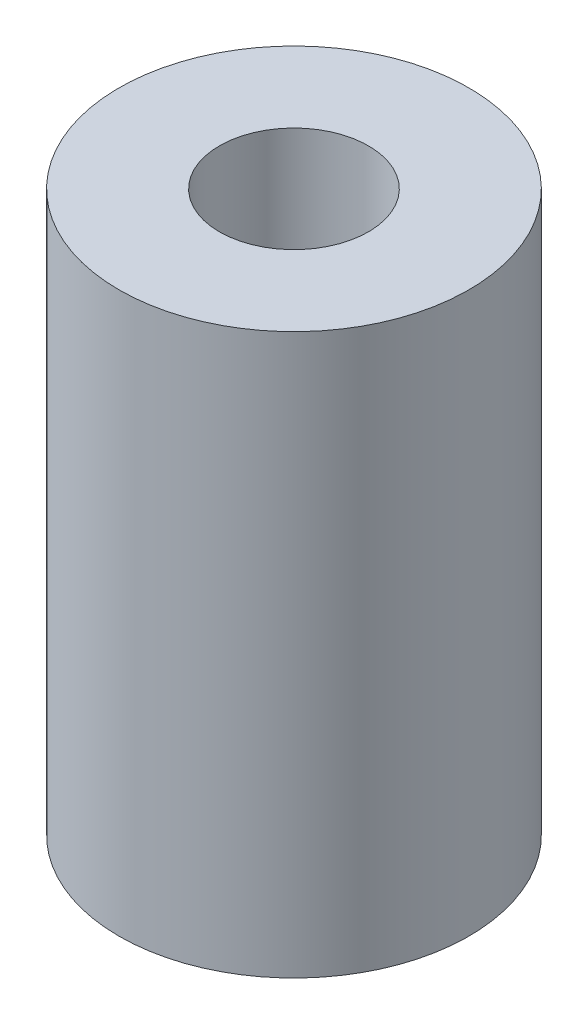
ISO-10303-21;
HEADER;
FILE_DESCRIPTION(('STEP AP214'),'2;1');
FILE_NAME('part.step','',(''),(''),'','','');
FILE_SCHEMA(('AUTOMOTIVE_DESIGN { 1 0 10303 214 1 1 1 1 }'));
ENDSEC;
DATA;
#1=APPLICATION_CONTEXT('core data for automotive mechanical design processes');
#2=APPLICATION_PROTOCOL_DEFINITION('international standard','automotive_design',2000,#1);
#3=PRODUCT_CONTEXT('',#1,'mechanical');
#4=PRODUCT('Part','Part','',(#3));
#5=PRODUCT_RELATED_PRODUCT_CATEGORY('part','',(#4));
#6=PRODUCT_DEFINITION_FORMATION('','',#4);
#7=PRODUCT_DEFINITION_CONTEXT('part definition',#1,'design');
#8=PRODUCT_DEFINITION('design','',#6,#7);
#9=PRODUCT_DEFINITION_SHAPE('','',#8);
#10=(LENGTH_UNIT() NAMED_UNIT(*) SI_UNIT(.MILLI.,.METRE.));
#11=(NAMED_UNIT(*) PLANE_ANGLE_UNIT() SI_UNIT($,.RADIAN.));
#12=(NAMED_UNIT(*) SI_UNIT($,.STERADIAN.) SOLID_ANGLE_UNIT());
#13=UNCERTAINTY_MEASURE_WITH_UNIT(LENGTH_MEASURE(1.E-05),#10,'distance_accuracy_value','');
#14=(GEOMETRIC_REPRESENTATION_CONTEXT(3) GLOBAL_UNCERTAINTY_ASSIGNED_CONTEXT((#13)) GLOBAL_UNIT_ASSIGNED_CONTEXT((#10,
#11,#12)) REPRESENTATION_CONTEXT('',''));
#15=CARTESIAN_POINT('',(0.,0.,0.));
#16=DIRECTION('',(0.,0.,1.));
#17=DIRECTION('',(1.,0.,0.));
#18=AXIS2_PLACEMENT_3D('',#15,#16,#17);
#19=CARTESIAN_POINT('',(0.,10.16,0.));
#20=DIRECTION('',(0.,-1.,0.));
#21=DIRECTION('',(0.,0.,-1.));
#22=AXIS2_PLACEMENT_3D('',#19,#20,#21);
#23=CYLINDRICAL_SURFACE('',#22,3.175);
#24=CARTESIAN_POINT('',(0.,10.16,0.));
#25=DIRECTION('',(0.,1.,0.));
#26=DIRECTION('',(0.,0.,1.));
#27=AXIS2_PLACEMENT_3D('',#24,#25,#26);
#28=CIRCLE('',#27,3.175);
#29=CARTESIAN_POINT('',(0.,10.16,3.175));
#30=VERTEX_POINT('',#29);
#31=EDGE_CURVE('E10',#30,#30,#28,.T.);
#32=ORIENTED_EDGE('',*,*,#31,.F.);
#33=EDGE_LOOP('',(#32));
#34=FACE_BOUND('',#33,.T.);
#35=CARTESIAN_POINT('',(0.,0.,0.));
#36=DIRECTION('',(0.,1.,0.));
#37=DIRECTION('',(0.,0.,1.));
#38=AXIS2_PLACEMENT_3D('',#35,#36,#37);
#39=CIRCLE('',#38,3.175);
#40=CARTESIAN_POINT('',(0.,0.,3.175));
#41=VERTEX_POINT('',#40);
#42=EDGE_CURVE('E34',#41,#41,#39,.T.);
#43=ORIENTED_EDGE('',*,*,#42,.T.);
#44=EDGE_LOOP('',(#43));
#45=FACE_BOUND('',#44,.T.);
#46=ADVANCED_FACE('F31',(#34,#45),#23,.T.);
#47=CARTESIAN_POINT('',(0.,10.16,0.));
#48=DIRECTION('',(0.,1.,0.));
#49=DIRECTION('',(0.,0.,1.));
#50=AXIS2_PLACEMENT_3D('',#47,#48,#49);
#51=PLANE('',#50);
#52=CARTESIAN_POINT('',(0.,10.16,0.));
#53=DIRECTION('',(0.,1.,0.));
#54=DIRECTION('',(0.,0.,1.));
#55=AXIS2_PLACEMENT_3D('',#52,#53,#54);
#56=CIRCLE('',#55,1.35255);
#57=CARTESIAN_POINT('',(0.,10.16,1.35255));
#58=VERTEX_POINT('',#57);
#59=EDGE_CURVE('E45',#58,#58,#56,.T.);
#60=ORIENTED_EDGE('',*,*,#59,.F.);
#61=EDGE_LOOP('',(#60));
#62=FACE_BOUND('',#61,.T.);
#63=ORIENTED_EDGE('',*,*,#31,.T.);
#64=EDGE_LOOP('',(#63));
#65=FACE_BOUND('',#64,.T.);
#66=ADVANCED_FACE('F51',(#62,#65),#51,.T.);
#67=CARTESIAN_POINT('',(0.,0.,0.));
#68=DIRECTION('',(0.,1.,0.));
#69=DIRECTION('',(0.,0.,1.));
#70=AXIS2_PLACEMENT_3D('',#67,#68,#69);
#71=PLANE('',#70);
#72=CARTESIAN_POINT('',(0.,0.,0.));
#73=DIRECTION('',(0.,1.,0.));
#74=DIRECTION('',(0.,0.,1.));
#75=AXIS2_PLACEMENT_3D('',#72,#73,#74);
#76=CIRCLE('',#75,1.35255);
#77=CARTESIAN_POINT('',(0.,0.,1.35255));
#78=VERTEX_POINT('',#77);
#79=EDGE_CURVE('E41',#78,#78,#76,.T.);
#80=ORIENTED_EDGE('',*,*,#79,.T.);
#81=EDGE_LOOP('',(#80));
#82=FACE_BOUND('',#81,.T.);
#83=ORIENTED_EDGE('',*,*,#42,.F.);
#84=EDGE_LOOP('',(#83));
#85=FACE_BOUND('',#84,.T.);
#86=ADVANCED_FACE('F53',(#82,#85),#71,.F.);
#87=CARTESIAN_POINT('',(0.,10.16,0.));
#88=DIRECTION('',(0.,1.,0.));
#89=DIRECTION('',(0.,0.,1.));
#90=AXIS2_PLACEMENT_3D('',#87,#88,#89);
#91=CYLINDRICAL_SURFACE('',#90,1.35255);
#92=ORIENTED_EDGE('',*,*,#79,.F.);
#93=EDGE_LOOP('',(#92));
#94=FACE_BOUND('',#93,.T.);
#95=ORIENTED_EDGE('',*,*,#59,.T.);
#96=EDGE_LOOP('',(#95));
#97=FACE_BOUND('',#96,.T.);
#98=ADVANCED_FACE('F49',(#94,#97),#91,.F.);
#99=CLOSED_SHELL('',(#46,#66,#86,#98));
#100=MANIFOLD_SOLID_BREP('B2',#99);
#101=ADVANCED_BREP_SHAPE_REPRESENTATION('',(#18,#100),#14);
#102=SHAPE_DEFINITION_REPRESENTATION(#9,#101);
ENDSEC;
END-ISO-10303-21;
